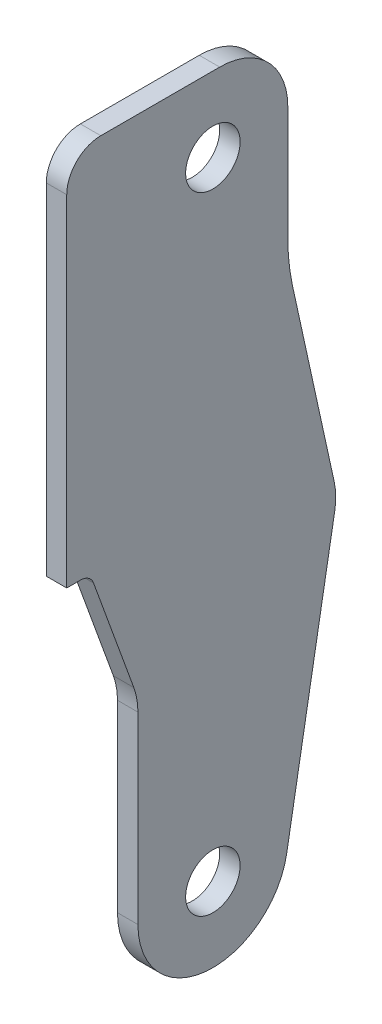
ISO-10303-21;
HEADER;
FILE_DESCRIPTION(('STEP AP214'),'2;1');
FILE_NAME('part.step','',(''),(''),'','','');
FILE_SCHEMA(('AUTOMOTIVE_DESIGN { 1 0 10303 214 1 1 1 1 }'));
ENDSEC;
DATA;
#1=APPLICATION_CONTEXT('core data for automotive mechanical design processes');
#2=APPLICATION_PROTOCOL_DEFINITION('international standard','automotive_design',2000,#1);
#3=PRODUCT_CONTEXT('',#1,'mechanical');
#4=PRODUCT('Part','Part','',(#3));
#5=PRODUCT_RELATED_PRODUCT_CATEGORY('part','',(#4));
#6=PRODUCT_DEFINITION_FORMATION('','',#4);
#7=PRODUCT_DEFINITION_CONTEXT('part definition',#1,'design');
#8=PRODUCT_DEFINITION('design','',#6,#7);
#9=PRODUCT_DEFINITION_SHAPE('','',#8);
#10=(LENGTH_UNIT() NAMED_UNIT(*) SI_UNIT(.MILLI.,.METRE.));
#11=(NAMED_UNIT(*) PLANE_ANGLE_UNIT() SI_UNIT($,.RADIAN.));
#12=(NAMED_UNIT(*) SI_UNIT($,.STERADIAN.) SOLID_ANGLE_UNIT());
#13=UNCERTAINTY_MEASURE_WITH_UNIT(LENGTH_MEASURE(1.E-05),#10,'distance_accuracy_value','');
#14=(GEOMETRIC_REPRESENTATION_CONTEXT(3) GLOBAL_UNCERTAINTY_ASSIGNED_CONTEXT((#13)) GLOBAL_UNIT_ASSIGNED_CONTEXT((#10,
#11,#12)) REPRESENTATION_CONTEXT('',''));
#15=CARTESIAN_POINT('',(0.,0.,0.));
#16=DIRECTION('',(0.,0.,1.));
#17=DIRECTION('',(1.,0.,0.));
#18=AXIS2_PLACEMENT_3D('',#15,#16,#17);
#19=CARTESIAN_POINT('',(17.5,-190.,21.4494897427832));
#20=DIRECTION('',(0.,0.,1.));
#21=DIRECTION('',(1.,0.,0.));
#22=AXIS2_PLACEMENT_3D('',#19,#20,#21);
#23=PLANE('',#22);
#24=DIRECTION('',(0.,1.,0.));
#25=VECTOR('',#24,1.);
#26=CARTESIAN_POINT('',(17.5,-190.,21.4494897427832));
#27=LINE('',#26,#25);
#28=CARTESIAN_POINT('',(17.5,-190.,21.4494897427832));
#29=VERTEX_POINT('',#28);
#30=CARTESIAN_POINT('',(17.5,-140.,21.4494897427832));
#31=VERTEX_POINT('',#30);
#32=EDGE_CURVE('E183',#29,#31,#27,.T.);
#33=ORIENTED_EDGE('',*,*,#32,.T.);
#34=DIRECTION('',(-1.,0.,0.));
#35=VECTOR('',#34,1.);
#36=CARTESIAN_POINT('',(17.5,-140.,21.4494897427832));
#37=LINE('',#36,#35);
#38=CARTESIAN_POINT('',(14.5,-140.,21.4494897427832));
#39=VERTEX_POINT('',#38);
#40=EDGE_CURVE('E251',#31,#39,#37,.T.);
#41=ORIENTED_EDGE('',*,*,#40,.T.);
#42=DIRECTION('',(0.,1.,0.));
#43=VECTOR('',#42,1.);
#44=CARTESIAN_POINT('',(14.5,-190.,21.4494897427832));
#45=LINE('',#44,#43);
#46=CARTESIAN_POINT('',(14.5,-190.,21.4494897427832));
#47=VERTEX_POINT('',#46);
#48=EDGE_CURVE('E179',#47,#39,#45,.T.);
#49=ORIENTED_EDGE('',*,*,#48,.F.);
#50=DIRECTION('',(-1.,0.,0.));
#51=VECTOR('',#50,1.);
#52=CARTESIAN_POINT('',(17.5,-190.,21.4494897427832));
#53=LINE('',#52,#51);
#54=EDGE_CURVE('E249',#29,#47,#53,.T.);
#55=ORIENTED_EDGE('',*,*,#54,.F.);
#56=EDGE_LOOP('',(#33,#41,#49,#55));
#57=FACE_BOUND('',#56,.T.);
#58=ADVANCED_FACE('F38',(#57),#23,.T.);
#59=CARTESIAN_POINT('',(17.5,-190.000000000001,19.40041507642));
#60=DIRECTION('',(0.,-1.,5.28271354274638E-13));
#61=DIRECTION('',(0.,-5.28271354274638E-13,-1.));
#62=AXIS2_PLACEMENT_3D('',#59,#60,#61);
#63=PLANE('',#62);
#64=ORIENTED_EDGE('',*,*,#54,.T.);
#65=DIRECTION('',(0.,5.28271354274638E-13,1.));
#66=VECTOR('',#65,1.);
#67=CARTESIAN_POINT('',(14.5,-190.000000000001,19.40041507642));
#68=LINE('',#67,#66);
#69=CARTESIAN_POINT('',(14.5,-190.000000000002,19.40041507642));
#70=VERTEX_POINT('',#69);
#71=EDGE_CURVE('E187',#70,#47,#68,.T.);
#72=ORIENTED_EDGE('',*,*,#71,.F.);
#73=DIRECTION('',(-1.,0.,0.));
#74=VECTOR('',#73,1.);
#75=CARTESIAN_POINT('',(17.5,-190.000000000002,19.40041507642));
#76=LINE('',#75,#74);
#77=CARTESIAN_POINT('',(17.5,-190.000000000002,19.40041507642));
#78=VERTEX_POINT('',#77);
#79=EDGE_CURVE('E252',#78,#70,#76,.T.);
#80=ORIENTED_EDGE('',*,*,#79,.F.);
#81=DIRECTION('',(0.,5.28271354274638E-13,1.));
#82=VECTOR('',#81,1.);
#83=CARTESIAN_POINT('',(17.5,-190.000000000001,19.40041507642));
#84=LINE('',#83,#82);
#85=EDGE_CURVE('E217',#78,#29,#84,.T.);
#86=ORIENTED_EDGE('',*,*,#85,.T.);
#87=EDGE_LOOP('',(#64,#72,#80,#86));
#88=FACE_BOUND('',#87,.T.);
#89=ADVANCED_FACE('F282',(#88),#63,.T.);
#90=CARTESIAN_POINT('',(17.5,-192.,19.40041507642));
#91=DIRECTION('',(-1.,0.,0.));
#92=DIRECTION('',(0.,0.,1.));
#93=AXIS2_PLACEMENT_3D('',#90,#91,#92);
#94=CYLINDRICAL_SURFACE('',#93,1.99999999999838);
#95=ORIENTED_EDGE('',*,*,#79,.T.);
#96=CARTESIAN_POINT('',(14.5,-192.,19.40041507642));
#97=DIRECTION('',(1.,0.,0.));
#98=DIRECTION('',(0.,0.,1.));
#99=AXIS2_PLACEMENT_3D('',#96,#97,#98);
#100=CIRCLE('',#99,1.99999999999838);
#101=CARTESIAN_POINT('',(14.5,-191.31595971335,17.52102983485));
#102=VERTEX_POINT('',#101);
#103=EDGE_CURVE('E244',#102,#70,#100,.T.);
#104=ORIENTED_EDGE('',*,*,#103,.F.);
#105=DIRECTION('',(-1.,0.,0.));
#106=VECTOR('',#105,1.);
#107=CARTESIAN_POINT('',(17.5,-191.31595971335,17.52102983485));
#108=LINE('',#107,#106);
#109=CARTESIAN_POINT('',(17.5,-191.31595971335,17.52102983485));
#110=VERTEX_POINT('',#109);
#111=EDGE_CURVE('E254',#110,#102,#108,.T.);
#112=ORIENTED_EDGE('',*,*,#111,.F.);
#113=CARTESIAN_POINT('',(17.5,-192.,19.40041507642));
#114=DIRECTION('',(1.,0.,0.));
#115=DIRECTION('',(0.,0.,1.));
#116=AXIS2_PLACEMENT_3D('',#113,#114,#115);
#117=CIRCLE('',#116,1.99999999999838);
#118=EDGE_CURVE('E214',#110,#78,#117,.T.);
#119=ORIENTED_EDGE('',*,*,#118,.T.);
#120=EDGE_LOOP('',(#95,#104,#112,#119));
#121=FACE_BOUND('',#120,.T.);
#122=ADVANCED_FACE('F302',(#121),#94,.F.);
#123=CARTESIAN_POINT('',(17.5,-207.57541031001,11.6030737921409));
#124=DIRECTION('',(0.,-0.342020143325815,0.939692620785855));
#125=DIRECTION('',(0.,-0.939692620785855,-0.342020143325815));
#126=AXIS2_PLACEMENT_3D('',#123,#124,#125);
#127=PLANE('',#126);
#128=ORIENTED_EDGE('',*,*,#111,.T.);
#129=DIRECTION('',(0.,0.939692620785855,0.342020143325814));
#130=VECTOR('',#129,1.);
#131=CARTESIAN_POINT('',(14.5,-207.57541031001,11.6030737921409));
#132=LINE('',#131,#130);
#133=CARTESIAN_POINT('',(14.5,-207.575410310011,11.6030737921414));
#134=VERTEX_POINT('',#133);
#135=EDGE_CURVE('E241',#134,#102,#132,.T.);
#136=ORIENTED_EDGE('',*,*,#135,.F.);
#137=DIRECTION('',(-1.,0.,0.));
#138=VECTOR('',#137,1.);
#139=CARTESIAN_POINT('',(17.5,-207.575410310011,11.6030737921414));
#140=LINE('',#139,#138);
#141=CARTESIAN_POINT('',(17.5,-207.575410310011,11.6030737921414));
#142=VERTEX_POINT('',#141);
#143=EDGE_CURVE('E256',#142,#134,#140,.T.);
#144=ORIENTED_EDGE('',*,*,#143,.F.);
#145=DIRECTION('',(0.,0.939692620785855,0.342020143325814));
#146=VECTOR('',#145,1.);
#147=CARTESIAN_POINT('',(17.5,-207.57541031001,11.6030737921409));
#148=LINE('',#147,#146);
#149=EDGE_CURVE('E211',#142,#110,#148,.T.);
#150=ORIENTED_EDGE('',*,*,#149,.T.);
#151=EDGE_LOOP('',(#128,#136,#144,#150));
#152=FACE_BOUND('',#151,.T.);
#153=ADVANCED_FACE('F337',(#152),#127,.T.);
#154=CARTESIAN_POINT('',(17.5,-210.99561174327,21.));
#155=DIRECTION('',(-1.,0.,0.));
#156=DIRECTION('',(0.,0.,1.));
#157=AXIS2_PLACEMENT_3D('',#154,#155,#156);
#158=CYLINDRICAL_SURFACE('',#157,10.0000000000005);
#159=ORIENTED_EDGE('',*,*,#143,.T.);
#160=CARTESIAN_POINT('',(14.5,-210.99561174327,21.));
#161=DIRECTION('',(1.,0.,0.));
#162=DIRECTION('',(0.,0.,1.));
#163=AXIS2_PLACEMENT_3D('',#160,#161,#162);
#164=CIRCLE('',#163,10.0000000000005);
#165=CARTESIAN_POINT('',(14.5,-210.99561174327,11.));
#166=VERTEX_POINT('',#165);
#167=EDGE_CURVE('E238',#166,#134,#164,.T.);
#168=ORIENTED_EDGE('',*,*,#167,.F.);
#169=DIRECTION('',(-1.,0.,0.));
#170=VECTOR('',#169,1.);
#171=CARTESIAN_POINT('',(17.5,-210.99561174327,11.));
#172=LINE('',#171,#170);
#173=CARTESIAN_POINT('',(17.5,-210.99561174327,11.));
#174=VERTEX_POINT('',#173);
#175=EDGE_CURVE('E258',#174,#166,#172,.T.);
#176=ORIENTED_EDGE('',*,*,#175,.F.);
#177=CARTESIAN_POINT('',(17.5,-210.99561174327,21.));
#178=DIRECTION('',(1.,0.,0.));
#179=DIRECTION('',(0.,0.,1.));
#180=AXIS2_PLACEMENT_3D('',#177,#178,#179);
#181=CIRCLE('',#180,10.0000000000005);
#182=EDGE_CURVE('E208',#174,#142,#181,.T.);
#183=ORIENTED_EDGE('',*,*,#182,.T.);
#184=EDGE_LOOP('',(#159,#168,#176,#183));
#185=FACE_BOUND('',#184,.T.);
#186=ADVANCED_FACE('F333',(#185),#158,.F.);
#187=CARTESIAN_POINT('',(17.5,-238.,10.9999999999979));
#188=DIRECTION('',(0.,0.,1.));
#189=DIRECTION('',(0.,-1.,0.));
#190=AXIS2_PLACEMENT_3D('',#187,#188,#189);
#191=PLANE('',#190);
#192=ORIENTED_EDGE('',*,*,#175,.T.);
#193=DIRECTION('',(0.,1.,0.));
#194=VECTOR('',#193,1.);
#195=CARTESIAN_POINT('',(14.5,-238.,10.9999999999979));
#196=LINE('',#195,#194);
#197=CARTESIAN_POINT('',(14.5,-238.,10.9999999999969));
#198=VERTEX_POINT('',#197);
#199=EDGE_CURVE('E235',#198,#166,#196,.T.);
#200=ORIENTED_EDGE('',*,*,#199,.F.);
#201=DIRECTION('',(-1.,0.,0.));
#202=VECTOR('',#201,1.);
#203=CARTESIAN_POINT('',(17.5,-238.,10.9999999999969));
#204=LINE('',#203,#202);
#205=CARTESIAN_POINT('',(17.5,-238.,10.9999999999969));
#206=VERTEX_POINT('',#205);
#207=EDGE_CURVE('E260',#206,#198,#204,.T.);
#208=ORIENTED_EDGE('',*,*,#207,.F.);
#209=DIRECTION('',(0.,1.,0.));
#210=VECTOR('',#209,1.);
#211=CARTESIAN_POINT('',(17.5,-238.,10.9999999999979));
#212=LINE('',#211,#210);
#213=EDGE_CURVE('E205',#206,#174,#212,.T.);
#214=ORIENTED_EDGE('',*,*,#213,.T.);
#215=EDGE_LOOP('',(#192,#200,#208,#214));
#216=FACE_BOUND('',#215,.T.);
#217=ADVANCED_FACE('F329',(#216),#191,.T.);
#218=CARTESIAN_POINT('',(17.5,-238.,0.));
#219=DIRECTION('',(-1.,0.,0.));
#220=DIRECTION('',(0.,0.,1.));
#221=AXIS2_PLACEMENT_3D('',#218,#219,#220);
#222=CYLINDRICAL_SURFACE('',#221,10.9999999999969);
#223=ORIENTED_EDGE('',*,*,#207,.T.);
#224=CARTESIAN_POINT('',(14.5,-238.,0.));
#225=DIRECTION('',(-1.,0.,0.));
#226=DIRECTION('',(0.,0.,1.));
#227=AXIS2_PLACEMENT_3D('',#224,#225,#226);
#228=CIRCLE('',#227,10.9999999999969);
#229=CARTESIAN_POINT('',(14.5,-239.91012995434,-10.83288528313));
#230=VERTEX_POINT('',#229);
#231=EDGE_CURVE('E232',#230,#198,#228,.T.);
#232=ORIENTED_EDGE('',*,*,#231,.F.);
#233=DIRECTION('',(-1.,0.,0.));
#234=VECTOR('',#233,1.);
#235=CARTESIAN_POINT('',(17.5,-239.91012995434,-10.83288528313));
#236=LINE('',#235,#234);
#237=CARTESIAN_POINT('',(17.5,-239.91012995434,-10.83288528313));
#238=VERTEX_POINT('',#237);
#239=EDGE_CURVE('E262',#238,#230,#236,.T.);
#240=ORIENTED_EDGE('',*,*,#239,.F.);
#241=CARTESIAN_POINT('',(17.5,-238.,0.));
#242=DIRECTION('',(-1.,0.,0.));
#243=DIRECTION('',(0.,0.,1.));
#244=AXIS2_PLACEMENT_3D('',#241,#242,#243);
#245=CIRCLE('',#244,10.9999999999963);
#246=EDGE_CURVE('E203',#238,#206,#245,.T.);
#247=ORIENTED_EDGE('',*,*,#246,.T.);
#248=EDGE_LOOP('',(#223,#232,#240,#247));
#249=FACE_BOUND('',#248,.T.);
#250=ADVANCED_FACE('F325',(#249),#222,.T.);
#251=CARTESIAN_POINT('',(17.5,-199.94512735731,-17.8797935250715));
#252=DIRECTION('',(0.,-0.173648177666962,-0.984807753012202));
#253=DIRECTION('',(0.,0.984807753012202,-0.173648177666962));
#254=AXIS2_PLACEMENT_3D('',#251,#252,#253);
#255=PLANE('',#254);
#256=ORIENTED_EDGE('',*,*,#239,.T.);
#257=DIRECTION('',(0.,-0.984807753012202,0.173648177666962));
#258=VECTOR('',#257,1.);
#259=CARTESIAN_POINT('',(14.5,-199.94512735731,-17.8797935250715));
#260=LINE('',#259,#258);
#261=CARTESIAN_POINT('',(14.5,-199.94512735731,-17.8797935250723));
#262=VERTEX_POINT('',#261);
#263=EDGE_CURVE('E229',#262,#230,#260,.T.);
#264=ORIENTED_EDGE('',*,*,#263,.F.);
#265=DIRECTION('',(-1.,0.,0.));
#266=VECTOR('',#265,1.);
#267=CARTESIAN_POINT('',(17.5,-199.94512735731,-17.8797935250723));
#268=LINE('',#267,#266);
#269=CARTESIAN_POINT('',(17.5,-199.94512735731,-17.8797935250723));
#270=VERTEX_POINT('',#269);
#271=EDGE_CURVE('E264',#270,#262,#268,.T.);
#272=ORIENTED_EDGE('',*,*,#271,.F.);
#273=DIRECTION('',(0.,-0.984807753012202,0.173648177666962));
#274=VECTOR('',#273,1.);
#275=CARTESIAN_POINT('',(17.5,-199.94512735731,-17.8797935250715));
#276=LINE('',#275,#274);
#277=EDGE_CURVE('E200',#270,#238,#276,.T.);
#278=ORIENTED_EDGE('',*,*,#277,.T.);
#279=EDGE_LOOP('',(#256,#264,#272,#278));
#280=FACE_BOUND('',#279,.T.);
#281=ADVANCED_FACE('F321',(#280),#255,.T.);
#282=CARTESIAN_POINT('',(17.5,-198.20864558064,-8.031715994952));
#283=DIRECTION('',(-1.,0.,0.));
#284=DIRECTION('',(0.,0.,1.));
#285=AXIS2_PLACEMENT_3D('',#282,#283,#284);
#286=CYLINDRICAL_SURFACE('',#285,9.99999999999843);
#287=ORIENTED_EDGE('',*,*,#271,.T.);
#288=CARTESIAN_POINT('',(14.5,-198.20864558064,-8.031715994952));
#289=DIRECTION('',(-1.,0.,0.));
#290=DIRECTION('',(0.,0.,1.));
#291=AXIS2_PLACEMENT_3D('',#288,#289,#290);
#292=CIRCLE('',#291,9.99999999999843);
#293=CARTESIAN_POINT('',(14.5,-196.07054058552,-17.80046755438));
#294=VERTEX_POINT('',#293);
#295=EDGE_CURVE('E226',#294,#262,#292,.T.);
#296=ORIENTED_EDGE('',*,*,#295,.F.);
#297=DIRECTION('',(-1.,0.,0.));
#298=VECTOR('',#297,1.);
#299=CARTESIAN_POINT('',(17.5,-196.07054058552,-17.80046755438));
#300=LINE('',#299,#298);
#301=CARTESIAN_POINT('',(17.5,-196.07054058552,-17.80046755438));
#302=VERTEX_POINT('',#301);
#303=EDGE_CURVE('E266',#302,#294,#300,.T.);
#304=ORIENTED_EDGE('',*,*,#303,.F.);
#305=CARTESIAN_POINT('',(17.5,-198.20864558064,-8.031715994952));
#306=DIRECTION('',(-1.,0.,0.));
#307=DIRECTION('',(0.,0.,1.));
#308=AXIS2_PLACEMENT_3D('',#305,#306,#307);
#309=CIRCLE('',#308,9.99999999999843);
#310=EDGE_CURVE('E197',#302,#270,#309,.T.);
#311=ORIENTED_EDGE('',*,*,#310,.T.);
#312=EDGE_LOOP('',(#287,#296,#304,#311));
#313=FACE_BOUND('',#312,.T.);
#314=ADVANCED_FACE('F317',(#313),#286,.T.);
#315=CARTESIAN_POINT('',(17.5,-168.16964120508,-11.6937453217096));
#316=DIRECTION('',(0.,0.213810499511105,-0.976875155943077));
#317=DIRECTION('',(0.,0.976875155943077,0.213810499511105));
#318=AXIS2_PLACEMENT_3D('',#315,#316,#317);
#319=PLANE('',#318);
#320=ORIENTED_EDGE('',*,*,#303,.T.);
#321=DIRECTION('',(0.,-0.976875155943077,-0.213810499511105));
#322=VECTOR('',#321,1.);
#323=CARTESIAN_POINT('',(14.5,-168.16964120508,-11.6937453217096));
#324=LINE('',#323,#322);
#325=CARTESIAN_POINT('',(14.5,-168.16964120508,-11.6937453217094));
#326=VERTEX_POINT('',#325);
#327=EDGE_CURVE('E223',#326,#294,#324,.T.);
#328=ORIENTED_EDGE('',*,*,#327,.F.);
#329=DIRECTION('',(-1.,0.,0.));
#330=VECTOR('',#329,1.);
#331=CARTESIAN_POINT('',(17.5,-168.16964120508,-11.6937453217094));
#332=LINE('',#331,#330);
#333=CARTESIAN_POINT('',(17.5,-168.16964120508,-11.6937453217094));
#334=VERTEX_POINT('',#333);
#335=EDGE_CURVE('E268',#334,#326,#332,.T.);
#336=ORIENTED_EDGE('',*,*,#335,.F.);
#337=DIRECTION('',(0.,-0.976875155943077,-0.213810499511105));
#338=VECTOR('',#337,1.);
#339=CARTESIAN_POINT('',(17.5,-168.16964120508,-11.6937453217096));
#340=LINE('',#339,#338);
#341=EDGE_CURVE('E194',#334,#302,#340,.T.);
#342=ORIENTED_EDGE('',*,*,#341,.T.);
#343=EDGE_LOOP('',(#320,#328,#336,#342));
#344=FACE_BOUND('',#343,.T.);
#345=ADVANCED_FACE('F313',(#344),#319,.T.);
#346=CARTESIAN_POINT('',(17.5,-161.75532621974,-41.));
#347=DIRECTION('',(-1.,0.,0.));
#348=DIRECTION('',(0.,0.,1.));
#349=AXIS2_PLACEMENT_3D('',#346,#347,#348);
#350=CYLINDRICAL_SURFACE('',#349,29.9999999999998);
#351=ORIENTED_EDGE('',*,*,#335,.T.);
#352=CARTESIAN_POINT('',(14.5,-161.75532621974,-41.));
#353=DIRECTION('',(1.,0.,0.));
#354=DIRECTION('',(0.,0.,1.));
#355=AXIS2_PLACEMENT_3D('',#352,#353,#354);
#356=CIRCLE('',#355,29.9999999999998);
#357=CARTESIAN_POINT('',(14.5,-161.75532621974,-11.));
#358=VERTEX_POINT('',#357);
#359=EDGE_CURVE('E152',#358,#326,#356,.T.);
#360=ORIENTED_EDGE('',*,*,#359,.F.);
#361=DIRECTION('',(-1.,0.,0.));
#362=VECTOR('',#361,1.);
#363=CARTESIAN_POINT('',(17.5,-161.75532621974,-11.));
#364=LINE('',#363,#362);
#365=CARTESIAN_POINT('',(17.5,-161.75532621974,-11.));
#366=VERTEX_POINT('',#365);
#367=EDGE_CURVE('E148',#366,#358,#364,.T.);
#368=ORIENTED_EDGE('',*,*,#367,.F.);
#369=CARTESIAN_POINT('',(17.5,-161.75532621974,-41.));
#370=DIRECTION('',(1.,0.,0.));
#371=DIRECTION('',(0.,0.,1.));
#372=AXIS2_PLACEMENT_3D('',#369,#370,#371);
#373=CIRCLE('',#372,29.9999999999998);
#374=EDGE_CURVE('E191',#366,#334,#373,.T.);
#375=ORIENTED_EDGE('',*,*,#374,.T.);
#376=EDGE_LOOP('',(#351,#360,#368,#375));
#377=FACE_BOUND('',#376,.T.);
#378=ADVANCED_FACE('F310',(#377),#350,.F.);
#379=CARTESIAN_POINT('',(17.5,-153.292893218813,-10.9999999999989));
#380=DIRECTION('',(0.,1.32834234824646E-13,-1.));
#381=DIRECTION('',(0.,1.,1.32834234824646E-13));
#382=AXIS2_PLACEMENT_3D('',#379,#380,#381);
#383=PLANE('',#382);
#384=ORIENTED_EDGE('',*,*,#367,.T.);
#385=DIRECTION('',(0.,-1.,-1.32834234824646E-13));
#386=VECTOR('',#385,1.);
#387=CARTESIAN_POINT('',(14.5,-153.292893218813,-10.9999999999989));
#388=LINE('',#387,#386);
#389=CARTESIAN_POINT('',(14.5,-145.,-10.9999999999983));
#390=VERTEX_POINT('',#389);
#391=EDGE_CURVE('E143',#390,#358,#388,.T.);
#392=ORIENTED_EDGE('',*,*,#391,.F.);
#393=DIRECTION('',(-1.,0.,0.));
#394=VECTOR('',#393,1.);
#395=CARTESIAN_POINT('',(43.370057685087,-145.,-10.9999999999983));
#396=LINE('',#395,#394);
#397=CARTESIAN_POINT('',(17.5,-145.,-10.9999999999983));
#398=VERTEX_POINT('',#397);
#399=EDGE_CURVE('E147',#398,#390,#396,.T.);
#400=ORIENTED_EDGE('',*,*,#399,.F.);
#401=DIRECTION('',(0.,-1.,-1.32834234824646E-13));
#402=VECTOR('',#401,1.);
#403=CARTESIAN_POINT('',(17.5,-153.292893218813,-10.9999999999989));
#404=LINE('',#403,#402);
#405=EDGE_CURVE('E189',#398,#366,#404,.T.);
#406=ORIENTED_EDGE('',*,*,#405,.T.);
#407=EDGE_LOOP('',(#384,#392,#400,#406));
#408=FACE_BOUND('',#407,.T.);
#409=ADVANCED_FACE('F145',(#408),#383,.T.);
#410=CARTESIAN_POINT('',(17.5,-135.,21.4494897427832));
#411=DIRECTION('',(0.,1.,0.));
#412=DIRECTION('',(0.,0.,1.));
#413=AXIS2_PLACEMENT_3D('',#410,#411,#412);
#414=PLANE('',#413);
#415=DIRECTION('',(0.,0.,-1.));
#416=VECTOR('',#415,1.);
#417=CARTESIAN_POINT('',(14.5,-135.,21.4494897427832));
#418=LINE('',#417,#416);
#419=CARTESIAN_POINT('',(14.5,-135.,16.4494897427832));
#420=VERTEX_POINT('',#419);
#421=CARTESIAN_POINT('',(14.5,-135.,-0.999999999998242));
#422=VERTEX_POINT('',#421);
#423=EDGE_CURVE('E153',#420,#422,#418,.T.);
#424=ORIENTED_EDGE('',*,*,#423,.F.);
#425=DIRECTION('',(-1.,0.,0.));
#426=VECTOR('',#425,1.);
#427=CARTESIAN_POINT('',(17.5,-135.,16.4494897427832));
#428=LINE('',#427,#426);
#429=CARTESIAN_POINT('',(17.5,-135.,16.4494897427832));
#430=VERTEX_POINT('',#429);
#431=EDGE_CURVE('E46',#420,#430,#428,.F.);
#432=ORIENTED_EDGE('',*,*,#431,.T.);
#433=DIRECTION('',(0.,0.,-1.));
#434=VECTOR('',#433,1.);
#435=CARTESIAN_POINT('',(17.5,-135.,21.4494897427832));
#436=LINE('',#435,#434);
#437=CARTESIAN_POINT('',(17.5,-135.,-0.999999999998242));
#438=VERTEX_POINT('',#437);
#439=EDGE_CURVE('E186',#430,#438,#436,.T.);
#440=ORIENTED_EDGE('',*,*,#439,.T.);
#441=DIRECTION('',(-1.,0.,0.));
#442=VECTOR('',#441,1.);
#443=CARTESIAN_POINT('',(43.370057685087,-135.,-0.999999999998242));
#444=LINE('',#443,#442);
#445=EDGE_CURVE('E163',#438,#422,#444,.T.);
#446=ORIENTED_EDGE('',*,*,#445,.T.);
#447=EDGE_LOOP('',(#424,#432,#440,#446));
#448=FACE_BOUND('',#447,.T.);
#449=ADVANCED_FACE('F305',(#448),#414,.T.);
#450=CARTESIAN_POINT('',(17.5,-137.,7.292893218813));
#451=DIRECTION('',(-1.,0.,0.));
#452=DIRECTION('',(0.,0.,1.));
#453=AXIS2_PLACEMENT_3D('',#450,#451,#452);
#454=PLANE('',#453);
#455=CARTESIAN_POINT('',(17.5,-146.,1.54459778300975E-11));
#456=DIRECTION('',(-1.,0.,0.));
#457=DIRECTION('',(0.,0.,1.));
#458=AXIS2_PLACEMENT_3D('',#455,#456,#457);
#459=CIRCLE('',#458,3.99999999998523);
#460=CARTESIAN_POINT('',(17.5,-146.,4.00000000000068));
#461=VERTEX_POINT('',#460);
#462=EDGE_CURVE('E168',#461,#461,#459,.T.);
#463=ORIENTED_EDGE('',*,*,#462,.T.);
#464=EDGE_LOOP('',(#463));
#465=FACE_BOUND('',#464,.T.);
#466=ORIENTED_EDGE('',*,*,#439,.F.);
#467=CARTESIAN_POINT('',(17.5,-140.,16.4494897427832));
#468=DIRECTION('',(-1.,0.,0.));
#469=DIRECTION('',(0.,0.,1.));
#470=AXIS2_PLACEMENT_3D('',#467,#468,#469);
#471=CIRCLE('',#470,5.);
#472=EDGE_CURVE('E11',#430,#31,#471,.F.);
#473=ORIENTED_EDGE('',*,*,#472,.T.);
#474=ORIENTED_EDGE('',*,*,#32,.F.);
#475=ORIENTED_EDGE('',*,*,#85,.F.);
#476=ORIENTED_EDGE('',*,*,#118,.F.);
#477=ORIENTED_EDGE('',*,*,#149,.F.);
#478=ORIENTED_EDGE('',*,*,#182,.F.);
#479=ORIENTED_EDGE('',*,*,#213,.F.);
#480=ORIENTED_EDGE('',*,*,#246,.F.);
#481=ORIENTED_EDGE('',*,*,#277,.F.);
#482=ORIENTED_EDGE('',*,*,#310,.F.);
#483=ORIENTED_EDGE('',*,*,#341,.F.);
#484=ORIENTED_EDGE('',*,*,#374,.F.);
#485=ORIENTED_EDGE('',*,*,#405,.F.);
#486=CARTESIAN_POINT('',(17.5,-145.,-0.999999999998313));
#487=DIRECTION('',(-1.,0.,0.));
#488=DIRECTION('',(0.,0.,1.));
#489=AXIS2_PLACEMENT_3D('',#486,#487,#488);
#490=CIRCLE('',#489,10.);
#491=EDGE_CURVE('E162',#438,#398,#490,.T.);
#492=ORIENTED_EDGE('',*,*,#491,.F.);
#493=EDGE_LOOP('',(#466,#473,#474,#475,#476,#477,#478,#479,#480,#481,#482,#483,#484,#485,#492));
#494=FACE_BOUND('',#493,.T.);
#495=CARTESIAN_POINT('',(17.5,-237.999999999979,1.54456863965535E-11));
#496=DIRECTION('',(-1.,0.,0.));
#497=DIRECTION('',(0.,0.,1.));
#498=AXIS2_PLACEMENT_3D('',#495,#496,#497);
#499=CIRCLE('',#498,3.99999999997894);
#500=CARTESIAN_POINT('',(17.5,-237.999999999979,3.99999999999439));
#501=VERTEX_POINT('',#500);
#502=EDGE_CURVE('E176',#501,#501,#499,.T.);
#503=ORIENTED_EDGE('',*,*,#502,.T.);
#504=EDGE_LOOP('',(#503));
#505=FACE_BOUND('',#504,.T.);
#506=ADVANCED_FACE('F285',(#465,#494,#505),#454,.F.);
#507=CARTESIAN_POINT('',(14.5,-137.,7.292893218813));
#508=DIRECTION('',(-1.,0.,0.));
#509=DIRECTION('',(0.,0.,1.));
#510=AXIS2_PLACEMENT_3D('',#507,#508,#509);
#511=PLANE('',#510);
#512=CARTESIAN_POINT('',(14.5,-146.,1.54459778300975E-11));
#513=DIRECTION('',(-1.,0.,0.));
#514=DIRECTION('',(0.,0.,1.));
#515=AXIS2_PLACEMENT_3D('',#512,#513,#514);
#516=CIRCLE('',#515,3.99999999998523);
#517=CARTESIAN_POINT('',(14.5,-146.,4.00000000000068));
#518=VERTEX_POINT('',#517);
#519=EDGE_CURVE('E171',#518,#518,#516,.T.);
#520=ORIENTED_EDGE('',*,*,#519,.F.);
#521=EDGE_LOOP('',(#520));
#522=FACE_BOUND('',#521,.T.);
#523=ORIENTED_EDGE('',*,*,#48,.T.);
#524=CARTESIAN_POINT('',(14.5,-140.,16.4494897427832));
#525=DIRECTION('',(-1.,0.,0.));
#526=DIRECTION('',(0.,0.,1.));
#527=AXIS2_PLACEMENT_3D('',#524,#525,#526);
#528=CIRCLE('',#527,5.);
#529=EDGE_CURVE('E60',#39,#420,#528,.T.);
#530=ORIENTED_EDGE('',*,*,#529,.T.);
#531=ORIENTED_EDGE('',*,*,#423,.T.);
#532=CARTESIAN_POINT('',(14.5,-145.,-0.999999999998313));
#533=DIRECTION('',(-1.,0.,0.));
#534=DIRECTION('',(0.,0.,1.));
#535=AXIS2_PLACEMENT_3D('',#532,#533,#534);
#536=CIRCLE('',#535,10.);
#537=EDGE_CURVE('E160',#390,#422,#536,.F.);
#538=ORIENTED_EDGE('',*,*,#537,.F.);
#539=ORIENTED_EDGE('',*,*,#391,.T.);
#540=ORIENTED_EDGE('',*,*,#359,.T.);
#541=ORIENTED_EDGE('',*,*,#327,.T.);
#542=ORIENTED_EDGE('',*,*,#295,.T.);
#543=ORIENTED_EDGE('',*,*,#263,.T.);
#544=ORIENTED_EDGE('',*,*,#231,.T.);
#545=ORIENTED_EDGE('',*,*,#199,.T.);
#546=ORIENTED_EDGE('',*,*,#167,.T.);
#547=ORIENTED_EDGE('',*,*,#135,.T.);
#548=ORIENTED_EDGE('',*,*,#103,.T.);
#549=ORIENTED_EDGE('',*,*,#71,.T.);
#550=EDGE_LOOP('',(#523,#530,#531,#538,#539,#540,#541,#542,#543,#544,#545,#546,#547,#548,#549));
#551=FACE_BOUND('',#550,.T.);
#552=CARTESIAN_POINT('',(14.5,-237.999999999979,1.54456863965535E-11));
#553=DIRECTION('',(-1.,0.,0.));
#554=DIRECTION('',(0.,0.,1.));
#555=AXIS2_PLACEMENT_3D('',#552,#553,#554);
#556=CIRCLE('',#555,3.99999999997894);
#557=CARTESIAN_POINT('',(14.5,-237.999999999979,3.99999999999439));
#558=VERTEX_POINT('',#557);
#559=EDGE_CURVE('E180',#558,#558,#556,.T.);
#560=ORIENTED_EDGE('',*,*,#559,.F.);
#561=EDGE_LOOP('',(#560));
#562=FACE_BOUND('',#561,.T.);
#563=ADVANCED_FACE('F165',(#522,#551,#562),#511,.T.);
#564=CARTESIAN_POINT('',(17.5,-237.999999999979,1.54456863965535E-11));
#565=DIRECTION('',(-1.,0.,0.));
#566=DIRECTION('',(0.,0.,1.));
#567=AXIS2_PLACEMENT_3D('',#564,#565,#566);
#568=CYLINDRICAL_SURFACE('',#567,3.99999999997894);
#569=ORIENTED_EDGE('',*,*,#502,.F.);
#570=EDGE_LOOP('',(#569));
#571=FACE_BOUND('',#570,.T.);
#572=ORIENTED_EDGE('',*,*,#559,.T.);
#573=EDGE_LOOP('',(#572));
#574=FACE_BOUND('',#573,.T.);
#575=ADVANCED_FACE('F296',(#571,#574),#568,.F.);
#576=CARTESIAN_POINT('',(43.370057685087,-145.,-0.999999999998313));
#577=DIRECTION('',(-1.,0.,0.));
#578=DIRECTION('',(0.,0.,1.));
#579=AXIS2_PLACEMENT_3D('',#576,#577,#578);
#580=CYLINDRICAL_SURFACE('',#579,10.);
#581=ORIENTED_EDGE('',*,*,#445,.F.);
#582=ORIENTED_EDGE('',*,*,#491,.T.);
#583=ORIENTED_EDGE('',*,*,#399,.T.);
#584=ORIENTED_EDGE('',*,*,#537,.T.);
#585=EDGE_LOOP('',(#581,#582,#583,#584));
#586=FACE_BOUND('',#585,.T.);
#587=ADVANCED_FACE('F159',(#586),#580,.T.);
#588=CARTESIAN_POINT('',(17.5,-140.,16.4494897427832));
#589=DIRECTION('',(-1.,0.,0.));
#590=DIRECTION('',(0.,0.,1.));
#591=AXIS2_PLACEMENT_3D('',#588,#589,#590);
#592=CYLINDRICAL_SURFACE('',#591,5.);
#593=ORIENTED_EDGE('',*,*,#472,.F.);
#594=ORIENTED_EDGE('',*,*,#431,.F.);
#595=ORIENTED_EDGE('',*,*,#529,.F.);
#596=ORIENTED_EDGE('',*,*,#40,.F.);
#597=EDGE_LOOP('',(#593,#594,#595,#596));
#598=FACE_BOUND('',#597,.T.);
#599=ADVANCED_FACE('F40',(#598),#592,.T.);
#600=CARTESIAN_POINT('',(24.5,-146.,1.54459778300975E-11));
#601=DIRECTION('',(-1.,0.,0.));
#602=DIRECTION('',(0.,0.,1.));
#603=AXIS2_PLACEMENT_3D('',#600,#601,#602);
#604=CYLINDRICAL_SURFACE('',#603,3.99999999998523);
#605=ORIENTED_EDGE('',*,*,#519,.T.);
#606=EDGE_LOOP('',(#605));
#607=FACE_BOUND('',#606,.T.);
#608=ORIENTED_EDGE('',*,*,#462,.F.);
#609=EDGE_LOOP('',(#608));
#610=FACE_BOUND('',#609,.T.);
#611=ADVANCED_FACE('F289',(#607,#610),#604,.F.);
#612=CLOSED_SHELL('',(#58,#89,#122,#153,#186,#217,#250,#281,#314,#345,#378,#409,#449,#506,#563,
#575,#587,#599,#611));
#613=MANIFOLD_SOLID_BREP('B2',#612);
#614=ADVANCED_BREP_SHAPE_REPRESENTATION('',(#18,#613),#14);
#615=SHAPE_DEFINITION_REPRESENTATION(#9,#614);
ENDSEC;
END-ISO-10303-21;
